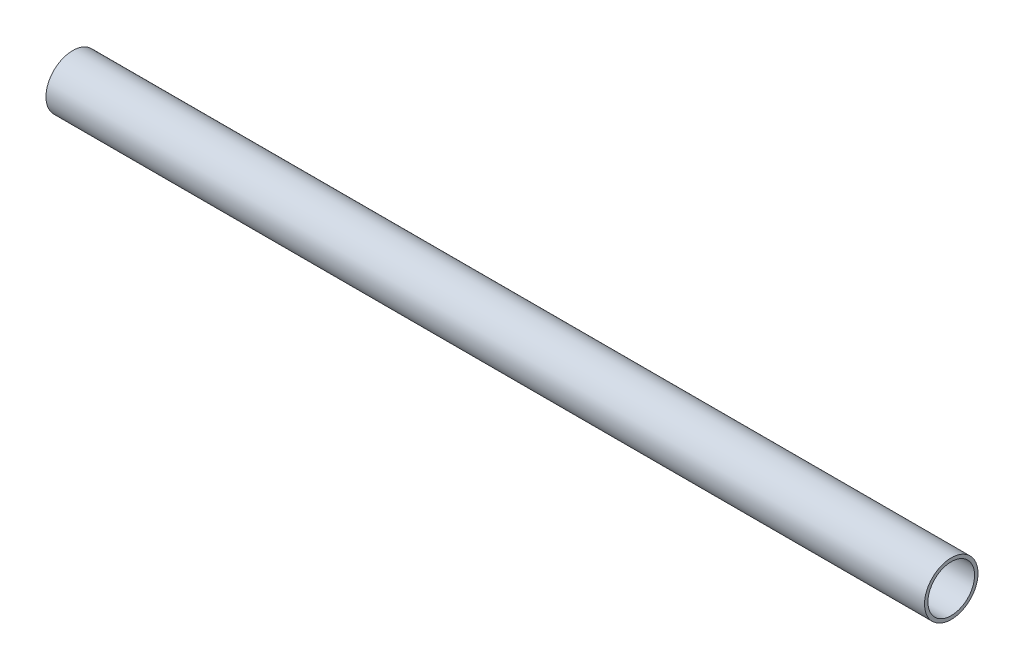
ISO-10303-21;
HEADER;
FILE_DESCRIPTION(('STEP AP214'),'2;1');
FILE_NAME('part.step','',(''),(''),'','','');
FILE_SCHEMA(('AUTOMOTIVE_DESIGN { 1 0 10303 214 1 1 1 1 }'));
ENDSEC;
DATA;
#1=APPLICATION_CONTEXT('core data for automotive mechanical design processes');
#2=APPLICATION_PROTOCOL_DEFINITION('international standard','automotive_design',2000,#1);
#3=PRODUCT_CONTEXT('',#1,'mechanical');
#4=PRODUCT('Part','Part','',(#3));
#5=PRODUCT_RELATED_PRODUCT_CATEGORY('part','',(#4));
#6=PRODUCT_DEFINITION_FORMATION('','',#4);
#7=PRODUCT_DEFINITION_CONTEXT('part definition',#1,'design');
#8=PRODUCT_DEFINITION('design','',#6,#7);
#9=PRODUCT_DEFINITION_SHAPE('','',#8);
#10=(LENGTH_UNIT() NAMED_UNIT(*) SI_UNIT(.MILLI.,.METRE.));
#11=(NAMED_UNIT(*) PLANE_ANGLE_UNIT() SI_UNIT($,.RADIAN.));
#12=(NAMED_UNIT(*) SI_UNIT($,.STERADIAN.) SOLID_ANGLE_UNIT());
#13=UNCERTAINTY_MEASURE_WITH_UNIT(LENGTH_MEASURE(1.E-05),#10,'distance_accuracy_value','');
#14=(GEOMETRIC_REPRESENTATION_CONTEXT(3) GLOBAL_UNCERTAINTY_ASSIGNED_CONTEXT((#13)) GLOBAL_UNIT_ASSIGNED_CONTEXT((#10,
#11,#12)) REPRESENTATION_CONTEXT('',''));
#15=CARTESIAN_POINT('',(0.,0.,0.));
#16=DIRECTION('',(0.,0.,1.));
#17=DIRECTION('',(1.,0.,0.));
#18=AXIS2_PLACEMENT_3D('',#15,#16,#17);
#19=CARTESIAN_POINT('',(208.5721,0.,0.));
#20=DIRECTION('',(1.,0.,0.));
#21=DIRECTION('',(0.,0.,-1.));
#22=AXIS2_PLACEMENT_3D('',#19,#20,#21);
#23=PLANE('',#22);
#24=CARTESIAN_POINT('',(208.5721,0.,0.));
#25=DIRECTION('',(1.,0.,0.));
#26=DIRECTION('',(0.,0.,-1.));
#27=AXIS2_PLACEMENT_3D('',#24,#25,#26);
#28=CIRCLE('',#27,6.35);
#29=CARTESIAN_POINT('',(208.5721,0.,-6.35));
#30=VERTEX_POINT('',#29);
#31=EDGE_CURVE('E10',#30,#30,#28,.T.);
#32=ORIENTED_EDGE('',*,*,#31,.T.);
#33=EDGE_LOOP('',(#32));
#34=FACE_BOUND('',#33,.T.);
#35=CARTESIAN_POINT('',(208.5721,0.,0.));
#36=DIRECTION('',(1.,0.,0.));
#37=DIRECTION('',(0.,0.,-1.));
#38=AXIS2_PLACEMENT_3D('',#35,#36,#37);
#39=CIRCLE('',#38,5.5372);
#40=CARTESIAN_POINT('',(208.5721,0.,-5.5372));
#41=VERTEX_POINT('',#40);
#42=EDGE_CURVE('E42',#41,#41,#39,.T.);
#43=ORIENTED_EDGE('',*,*,#42,.F.);
#44=EDGE_LOOP('',(#43));
#45=FACE_BOUND('',#44,.T.);
#46=ADVANCED_FACE('F31',(#34,#45),#23,.T.);
#47=CARTESIAN_POINT('',(0.,0.,0.));
#48=DIRECTION('',(1.,0.,0.));
#49=DIRECTION('',(0.,0.,-1.));
#50=AXIS2_PLACEMENT_3D('',#47,#48,#49);
#51=PLANE('',#50);
#52=CARTESIAN_POINT('',(0.,0.,0.));
#53=DIRECTION('',(1.,0.,0.));
#54=DIRECTION('',(0.,0.,-1.));
#55=AXIS2_PLACEMENT_3D('',#52,#53,#54);
#56=CIRCLE('',#55,6.35);
#57=CARTESIAN_POINT('',(0.,0.,-6.35));
#58=VERTEX_POINT('',#57);
#59=EDGE_CURVE('E35',#58,#58,#56,.T.);
#60=ORIENTED_EDGE('',*,*,#59,.F.);
#61=EDGE_LOOP('',(#60));
#62=FACE_BOUND('',#61,.T.);
#63=CARTESIAN_POINT('',(0.,0.,0.));
#64=DIRECTION('',(1.,0.,0.));
#65=DIRECTION('',(0.,0.,-1.));
#66=AXIS2_PLACEMENT_3D('',#63,#64,#65);
#67=CIRCLE('',#66,5.5372);
#68=CARTESIAN_POINT('',(0.,0.,-5.5372));
#69=VERTEX_POINT('',#68);
#70=EDGE_CURVE('E44',#69,#69,#67,.T.);
#71=ORIENTED_EDGE('',*,*,#70,.T.);
#72=EDGE_LOOP('',(#71));
#73=FACE_BOUND('',#72,.T.);
#74=ADVANCED_FACE('F54',(#62,#73),#51,.F.);
#75=CARTESIAN_POINT('',(208.5721,0.,0.));
#76=DIRECTION('',(-1.,0.,0.));
#77=DIRECTION('',(0.,0.,1.));
#78=AXIS2_PLACEMENT_3D('',#75,#76,#77);
#79=CYLINDRICAL_SURFACE('',#78,6.35);
#80=ORIENTED_EDGE('',*,*,#31,.F.);
#81=EDGE_LOOP('',(#80));
#82=FACE_BOUND('',#81,.T.);
#83=ORIENTED_EDGE('',*,*,#59,.T.);
#84=EDGE_LOOP('',(#83));
#85=FACE_BOUND('',#84,.T.);
#86=ADVANCED_FACE('F33',(#82,#85),#79,.T.);
#87=CARTESIAN_POINT('',(208.5721,0.,0.));
#88=DIRECTION('',(-1.,0.,0.));
#89=DIRECTION('',(0.,0.,1.));
#90=AXIS2_PLACEMENT_3D('',#87,#88,#89);
#91=CYLINDRICAL_SURFACE('',#90,5.5372);
#92=ORIENTED_EDGE('',*,*,#42,.T.);
#93=EDGE_LOOP('',(#92));
#94=FACE_BOUND('',#93,.T.);
#95=ORIENTED_EDGE('',*,*,#70,.F.);
#96=EDGE_LOOP('',(#95));
#97=FACE_BOUND('',#96,.T.);
#98=ADVANCED_FACE('F50',(#94,#97),#91,.F.);
#99=CLOSED_SHELL('',(#46,#74,#86,#98));
#100=MANIFOLD_SOLID_BREP('B2',#99);
#101=ADVANCED_BREP_SHAPE_REPRESENTATION('',(#18,#100),#14);
#102=SHAPE_DEFINITION_REPRESENTATION(#9,#101);
ENDSEC;
END-ISO-10303-21;
